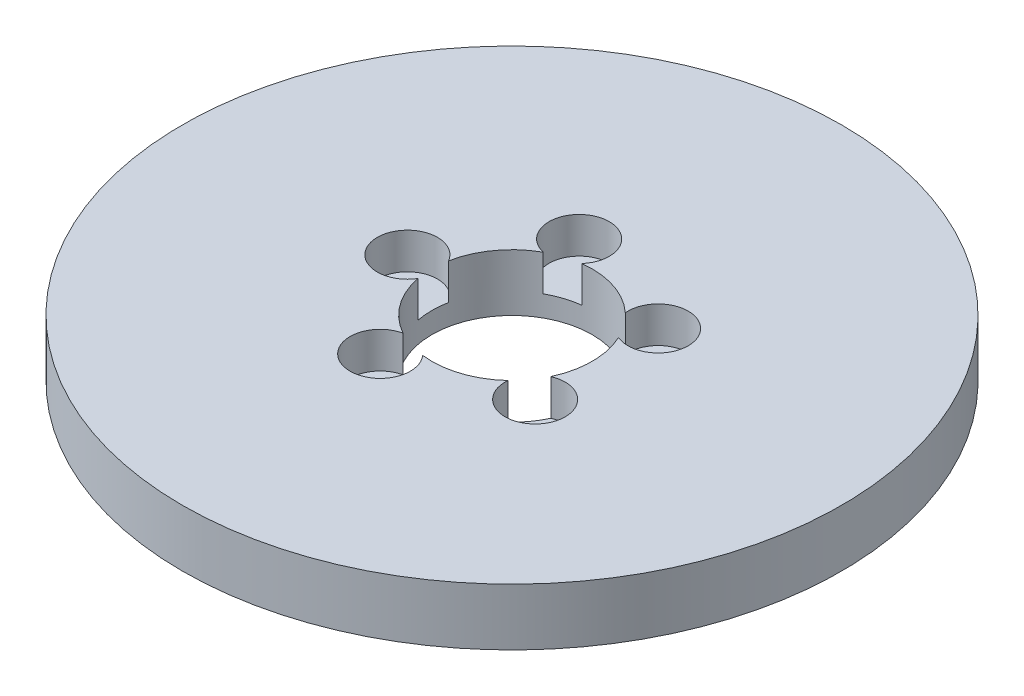
ISO-10303-21;
HEADER;
FILE_DESCRIPTION(('STEP AP214'),'2;1');
FILE_NAME('part.step','',(''),(''),'','','');
FILE_SCHEMA(('AUTOMOTIVE_DESIGN { 1 0 10303 214 1 1 1 1 }'));
ENDSEC;
DATA;
#1=APPLICATION_CONTEXT('core data for automotive mechanical design processes');
#2=APPLICATION_PROTOCOL_DEFINITION('international standard','automotive_design',2000,#1);
#3=PRODUCT_CONTEXT('',#1,'mechanical');
#4=PRODUCT('Part','Part','',(#3));
#5=PRODUCT_RELATED_PRODUCT_CATEGORY('part','',(#4));
#6=PRODUCT_DEFINITION_FORMATION('','',#4);
#7=PRODUCT_DEFINITION_CONTEXT('part definition',#1,'design');
#8=PRODUCT_DEFINITION('design','',#6,#7);
#9=PRODUCT_DEFINITION_SHAPE('','',#8);
#10=(LENGTH_UNIT() NAMED_UNIT(*) SI_UNIT(.MILLI.,.METRE.));
#11=(NAMED_UNIT(*) PLANE_ANGLE_UNIT() SI_UNIT($,.RADIAN.));
#12=(NAMED_UNIT(*) SI_UNIT($,.STERADIAN.) SOLID_ANGLE_UNIT());
#13=UNCERTAINTY_MEASURE_WITH_UNIT(LENGTH_MEASURE(1.E-05),#10,'distance_accuracy_value','');
#14=(GEOMETRIC_REPRESENTATION_CONTEXT(3) GLOBAL_UNCERTAINTY_ASSIGNED_CONTEXT((#13)) GLOBAL_UNIT_ASSIGNED_CONTEXT((#10,
#11,#12)) REPRESENTATION_CONTEXT('',''));
#15=CARTESIAN_POINT('',(0.,0.,0.));
#16=DIRECTION('',(0.,0.,1.));
#17=DIRECTION('',(1.,0.,0.));
#18=AXIS2_PLACEMENT_3D('',#15,#16,#17);
#19=CARTESIAN_POINT('',(0.,16.,0.));
#20=DIRECTION('',(0.,-1.,0.));
#21=DIRECTION('',(0.,0.,-1.));
#22=AXIS2_PLACEMENT_3D('',#19,#20,#21);
#23=CYLINDRICAL_SURFACE('',#22,92.5);
#24=CARTESIAN_POINT('',(0.,16.,0.));
#25=DIRECTION('',(0.,1.,0.));
#26=DIRECTION('',(0.,0.,1.));
#27=AXIS2_PLACEMENT_3D('',#24,#25,#26);
#28=CIRCLE('',#27,92.5);
#29=CARTESIAN_POINT('',(0.,16.,92.5));
#30=VERTEX_POINT('',#29);
#31=EDGE_CURVE('E157',#30,#30,#28,.T.);
#32=ORIENTED_EDGE('',*,*,#31,.F.);
#33=EDGE_LOOP('',(#32));
#34=FACE_BOUND('',#33,.T.);
#35=CARTESIAN_POINT('',(0.,0.,0.));
#36=DIRECTION('',(0.,1.,0.));
#37=DIRECTION('',(0.,0.,1.));
#38=AXIS2_PLACEMENT_3D('',#35,#36,#37);
#39=CIRCLE('',#38,92.5);
#40=CARTESIAN_POINT('',(0.,0.,92.5));
#41=VERTEX_POINT('',#40);
#42=EDGE_CURVE('E150',#41,#41,#39,.T.);
#43=ORIENTED_EDGE('',*,*,#42,.T.);
#44=EDGE_LOOP('',(#43));
#45=FACE_BOUND('',#44,.T.);
#46=ADVANCED_FACE('F39',(#34,#45),#23,.T.);
#47=CARTESIAN_POINT('',(0.,16.,0.));
#48=DIRECTION('',(0.,1.,0.));
#49=DIRECTION('',(0.,0.,1.));
#50=AXIS2_PLACEMENT_3D('',#47,#48,#49);
#51=PLANE('',#50);
#52=CARTESIAN_POINT('',(-9.07257051645491,16.,-27.9225009183538));
#53=DIRECTION('',(0.,1.,0.));
#54=DIRECTION('',(-0.95105651629515,0.,0.309016994374958));
#55=AXIS2_PLACEMENT_3D('',#52,#53,#54);
#56=CIRCLE('',#55,8.4477017152426);
#57=CARTESIAN_POINT('',(-2.73871040046969,16.,-22.3326994638436));
#58=VERTEX_POINT('',#57);
#59=CARTESIAN_POINT('',(-10.9111681320763,16.,-19.6773069802136));
#60=VERTEX_POINT('',#59);
#61=EDGE_CURVE('E194',#58,#60,#56,.T.);
#62=ORIENTED_EDGE('',*,*,#61,.F.);
#63=CARTESIAN_POINT('',(0.,16.,0.));
#64=DIRECTION('',(0.,1.,0.));
#65=DIRECTION('',(0.,0.,1.));
#66=AXIS2_PLACEMENT_3D('',#63,#64,#65);
#67=CIRCLE('',#66,22.5);
#68=CARTESIAN_POINT('',(15.3424946453783,16.,-16.457759812822));
#69=VERTEX_POINT('',#68);
#70=EDGE_CURVE('E147',#69,#58,#67,.T.);
#71=ORIENTED_EDGE('',*,*,#70,.F.);
#72=CARTESIAN_POINT('',(23.7522979774082,16.,-17.2570546184431));
#73=DIRECTION('',(0.,1.,0.));
#74=DIRECTION('',(-0.58778525229248,0.,-0.809016994374942));
#75=AXIS2_PLACEMENT_3D('',#72,#73,#74);
#76=CIRCLE('',#75,8.4477017152426);
#77=CARTESIAN_POINT('',(20.3933512951332,16.,-9.50585203720789));
#78=VERTEX_POINT('',#77);
#79=EDGE_CURVE('E254',#78,#69,#76,.T.);
#80=ORIENTED_EDGE('',*,*,#79,.F.);
#81=CARTESIAN_POINT('',(20.3933512951333,16.,9.5058520372076));
#82=VERTEX_POINT('',#81);
#83=EDGE_CURVE('E144',#82,#78,#67,.T.);
#84=ORIENTED_EDGE('',*,*,#83,.F.);
#85=CARTESIAN_POINT('',(23.7522979774084,16.,17.2570546184427));
#86=DIRECTION('',(0.,1.,0.));
#87=DIRECTION('',(0.587785252292469,0.,-0.809016994374951));
#88=AXIS2_PLACEMENT_3D('',#85,#86,#87);
#89=CIRCLE('',#88,8.4477017152426);
#90=CARTESIAN_POINT('',(15.3424946453786,16.,16.4577598128217));
#91=VERTEX_POINT('',#90);
#92=EDGE_CURVE('E141',#91,#82,#89,.T.);
#93=ORIENTED_EDGE('',*,*,#92,.F.);
#94=CARTESIAN_POINT('',(-2.73871040046937,16.,22.3326994638436));
#95=VERTEX_POINT('',#94);
#96=EDGE_CURVE('E134',#95,#91,#67,.T.);
#97=ORIENTED_EDGE('',*,*,#96,.F.);
#98=CARTESIAN_POINT('',(-9.07257051645452,16.,27.9225009183539));
#99=DIRECTION('',(0.,1.,0.));
#100=DIRECTION('',(0.951056516295155,0.,0.309016994374945));
#101=AXIS2_PLACEMENT_3D('',#98,#99,#100);
#102=CIRCLE('',#101,8.4477017152426);
#103=CARTESIAN_POINT('',(-10.9111681320761,16.,19.6773069802137));
#104=VERTEX_POINT('',#103);
#105=EDGE_CURVE('E111',#104,#95,#102,.T.);
#106=ORIENTED_EDGE('',*,*,#105,.F.);
#107=CARTESIAN_POINT('',(-22.0859674079662,16.,4.29651529198419));
#108=VERTEX_POINT('',#107);
#109=EDGE_CURVE('E145',#108,#104,#67,.T.);
#110=ORIENTED_EDGE('',*,*,#109,.F.);
#111=CARTESIAN_POINT('',(-29.3594549219074,16.,0.));
#112=DIRECTION('',(0.,1.,0.));
#113=DIRECTION('',(0.,0.,1.));
#114=AXIS2_PLACEMENT_3D('',#111,#112,#113);
#115=CIRCLE('',#114,8.4477017152426);
#116=CARTESIAN_POINT('',(-22.0859674079662,16.,-4.29651529198419));
#117=VERTEX_POINT('',#116);
#118=EDGE_CURVE('E153',#117,#108,#115,.T.);
#119=ORIENTED_EDGE('',*,*,#118,.F.);
#120=EDGE_CURVE('E146',#60,#117,#67,.T.);
#121=ORIENTED_EDGE('',*,*,#120,.F.);
#122=EDGE_LOOP('',(#62,#71,#80,#84,#93,#97,#106,#110,#119,#121));
#123=FACE_BOUND('',#122,.T.);
#124=ORIENTED_EDGE('',*,*,#31,.T.);
#125=EDGE_LOOP('',(#124));
#126=FACE_BOUND('',#125,.T.);
#127=ADVANCED_FACE('F139',(#123,#126),#51,.T.);
#128=CARTESIAN_POINT('',(0.,0.,0.));
#129=DIRECTION('',(0.,1.,0.));
#130=DIRECTION('',(0.,0.,1.));
#131=AXIS2_PLACEMENT_3D('',#128,#129,#130);
#132=PLANE('',#131);
#133=CARTESIAN_POINT('',(0.,0.,0.));
#134=DIRECTION('',(0.,1.,0.));
#135=DIRECTION('',(0.,0.,1.));
#136=AXIS2_PLACEMENT_3D('',#133,#134,#135);
#137=CIRCLE('',#136,22.5);
#138=CARTESIAN_POINT('',(0.,0.,22.5));
#139=VERTEX_POINT('',#138);
#140=EDGE_CURVE('E154',#139,#139,#137,.T.);
#141=ORIENTED_EDGE('',*,*,#140,.T.);
#142=EDGE_LOOP('',(#141));
#143=FACE_BOUND('',#142,.T.);
#144=ORIENTED_EDGE('',*,*,#42,.F.);
#145=EDGE_LOOP('',(#144));
#146=FACE_BOUND('',#145,.T.);
#147=ADVANCED_FACE('F213',(#143,#146),#132,.F.);
#148=CARTESIAN_POINT('',(0.,16.,0.));
#149=DIRECTION('',(0.,-1.,0.));
#150=DIRECTION('',(0.,0.,-1.));
#151=AXIS2_PLACEMENT_3D('',#148,#149,#150);
#152=CYLINDRICAL_SURFACE('',#151,22.5);
#153=DIRECTION('',(0.,1.,0.));
#154=VECTOR('',#153,1.);
#155=CARTESIAN_POINT('',(-2.73871040046969,10.933876950996,-22.3326994638436));
#156=LINE('',#155,#154);
#157=CARTESIAN_POINT('',(-2.73871040046969,5.86775390199197,-22.3326994638436));
#158=VERTEX_POINT('',#157);
#159=EDGE_CURVE('E11',#158,#58,#156,.T.);
#160=ORIENTED_EDGE('',*,*,#159,.F.);
#161=CARTESIAN_POINT('',(0.,5.86775390199197,0.));
#162=DIRECTION('',(0.,1.,0.));
#163=DIRECTION('',(0.,0.,1.));
#164=AXIS2_PLACEMENT_3D('',#161,#162,#163);
#165=CIRCLE('',#164,22.5);
#166=CARTESIAN_POINT('',(-10.9111681320763,5.86775390199197,-19.6773069802136));
#167=VERTEX_POINT('',#166);
#168=EDGE_CURVE('E189',#158,#167,#165,.T.);
#169=ORIENTED_EDGE('',*,*,#168,.T.);
#170=DIRECTION('',(0.,1.,0.));
#171=VECTOR('',#170,1.);
#172=CARTESIAN_POINT('',(-10.9111681320763,10.933876950996,-19.6773069802136));
#173=LINE('',#172,#171);
#174=EDGE_CURVE('E46',#60,#167,#173,.F.);
#175=ORIENTED_EDGE('',*,*,#174,.F.);
#176=ORIENTED_EDGE('',*,*,#120,.T.);
#177=DIRECTION('',(0.,1.,0.));
#178=VECTOR('',#177,1.);
#179=CARTESIAN_POINT('',(-22.0859674079662,10.933876950996,-4.29651529198418));
#180=LINE('',#179,#178);
#181=CARTESIAN_POINT('',(-22.0859674079662,5.86775390199197,-4.29651529198419));
#182=VERTEX_POINT('',#181);
#183=EDGE_CURVE('E168',#182,#117,#180,.T.);
#184=ORIENTED_EDGE('',*,*,#183,.F.);
#185=CARTESIAN_POINT('',(0.,5.86775390199197,0.));
#186=DIRECTION('',(0.,1.,0.));
#187=DIRECTION('',(0.,0.,1.));
#188=AXIS2_PLACEMENT_3D('',#185,#186,#187);
#189=CIRCLE('',#188,22.5);
#190=CARTESIAN_POINT('',(-22.0859674079662,5.86775390199197,4.29651529198419));
#191=VERTEX_POINT('',#190);
#192=EDGE_CURVE('E165',#182,#191,#189,.T.);
#193=ORIENTED_EDGE('',*,*,#192,.T.);
#194=DIRECTION('',(0.,1.,0.));
#195=VECTOR('',#194,1.);
#196=CARTESIAN_POINT('',(-22.0859674079662,10.933876950996,4.29651529198418));
#197=LINE('',#196,#195);
#198=EDGE_CURVE('E170',#108,#191,#197,.F.);
#199=ORIENTED_EDGE('',*,*,#198,.F.);
#200=ORIENTED_EDGE('',*,*,#109,.T.);
#201=DIRECTION('',(0.,1.,0.));
#202=VECTOR('',#201,1.);
#203=CARTESIAN_POINT('',(-10.911168132076,10.933876950996,19.6773069802137));
#204=LINE('',#203,#202);
#205=CARTESIAN_POINT('',(-10.9111681320761,5.86775390199197,19.6773069802137));
#206=VERTEX_POINT('',#205);
#207=EDGE_CURVE('E121',#206,#104,#204,.T.);
#208=ORIENTED_EDGE('',*,*,#207,.F.);
#209=CARTESIAN_POINT('',(0.,5.86775390199197,0.));
#210=DIRECTION('',(0.,1.,0.));
#211=DIRECTION('',(0.,0.,1.));
#212=AXIS2_PLACEMENT_3D('',#209,#210,#211);
#213=CIRCLE('',#212,22.5);
#214=CARTESIAN_POINT('',(-2.73871040046937,5.86775390199197,22.3326994638436));
#215=VERTEX_POINT('',#214);
#216=EDGE_CURVE('E136',#206,#215,#213,.T.);
#217=ORIENTED_EDGE('',*,*,#216,.T.);
#218=DIRECTION('',(0.,1.,0.));
#219=VECTOR('',#218,1.);
#220=CARTESIAN_POINT('',(-2.73871040046937,10.933876950996,22.3326994638436));
#221=LINE('',#220,#219);
#222=EDGE_CURVE('E117',#95,#215,#221,.F.);
#223=ORIENTED_EDGE('',*,*,#222,.F.);
#224=ORIENTED_EDGE('',*,*,#96,.T.);
#225=DIRECTION('',(0.,1.,0.));
#226=VECTOR('',#225,1.);
#227=CARTESIAN_POINT('',(15.3424946453786,10.933876950996,16.4577598128217));
#228=LINE('',#227,#226);
#229=CARTESIAN_POINT('',(15.3424946453786,5.86775390199197,16.4577598128217));
#230=VERTEX_POINT('',#229);
#231=EDGE_CURVE('E182',#230,#91,#228,.T.);
#232=ORIENTED_EDGE('',*,*,#231,.F.);
#233=CARTESIAN_POINT('',(0.,5.86775390199197,0.));
#234=DIRECTION('',(0.,1.,0.));
#235=DIRECTION('',(0.,0.,1.));
#236=AXIS2_PLACEMENT_3D('',#233,#234,#235);
#237=CIRCLE('',#236,22.5);
#238=CARTESIAN_POINT('',(20.3933512951333,5.86775390199197,9.5058520372076));
#239=VERTEX_POINT('',#238);
#240=EDGE_CURVE('E174',#230,#239,#237,.T.);
#241=ORIENTED_EDGE('',*,*,#240,.T.);
#242=DIRECTION('',(0.,1.,0.));
#243=VECTOR('',#242,1.);
#244=CARTESIAN_POINT('',(20.3933512951333,10.933876950996,9.5058520372076));
#245=LINE('',#244,#243);
#246=EDGE_CURVE('E177',#82,#239,#245,.F.);
#247=ORIENTED_EDGE('',*,*,#246,.F.);
#248=ORIENTED_EDGE('',*,*,#83,.T.);
#249=DIRECTION('',(0.,1.,0.));
#250=VECTOR('',#249,1.);
#251=CARTESIAN_POINT('',(20.3933512951332,10.933876950996,-9.50585203720789));
#252=LINE('',#251,#250);
#253=CARTESIAN_POINT('',(20.3933512951332,5.86775390199197,-9.50585203720789));
#254=VERTEX_POINT('',#253);
#255=EDGE_CURVE('E187',#254,#78,#252,.T.);
#256=ORIENTED_EDGE('',*,*,#255,.F.);
#257=CARTESIAN_POINT('',(0.,5.86775390199197,0.));
#258=DIRECTION('',(0.,1.,0.));
#259=DIRECTION('',(0.,0.,1.));
#260=AXIS2_PLACEMENT_3D('',#257,#258,#259);
#261=CIRCLE('',#260,22.5);
#262=CARTESIAN_POINT('',(15.3424946453783,5.86775390199197,-16.457759812822));
#263=VERTEX_POINT('',#262);
#264=EDGE_CURVE('E181',#254,#263,#261,.T.);
#265=ORIENTED_EDGE('',*,*,#264,.T.);
#266=DIRECTION('',(0.,1.,0.));
#267=VECTOR('',#266,1.);
#268=CARTESIAN_POINT('',(15.3424946453783,10.933876950996,-16.457759812822));
#269=LINE('',#268,#267);
#270=EDGE_CURVE('E186',#69,#263,#269,.F.);
#271=ORIENTED_EDGE('',*,*,#270,.F.);
#272=ORIENTED_EDGE('',*,*,#70,.T.);
#273=EDGE_LOOP('',(#160,#169,#175,#176,#184,#193,#199,#200,#208,#217,#223,#224,#232,#241,#247,
#248,#256,#265,#271,#272));
#274=FACE_BOUND('',#273,.T.);
#275=ORIENTED_EDGE('',*,*,#140,.F.);
#276=EDGE_LOOP('',(#275));
#277=FACE_BOUND('',#276,.T.);
#278=ADVANCED_FACE('F135',(#274,#277),#152,.F.);
#279=CARTESIAN_POINT('',(-29.3594549219074,5.86775390199197,0.));
#280=DIRECTION('',(0.,1.,0.));
#281=DIRECTION('',(0.,0.,1.));
#282=AXIS2_PLACEMENT_3D('',#279,#280,#281);
#283=CYLINDRICAL_SURFACE('',#282,8.4477017152426);
#284=ORIENTED_EDGE('',*,*,#183,.T.);
#285=ORIENTED_EDGE('',*,*,#118,.T.);
#286=ORIENTED_EDGE('',*,*,#198,.T.);
#287=CARTESIAN_POINT('',(-29.3594549219074,5.86775390199197,0.));
#288=DIRECTION('',(0.,1.,0.));
#289=DIRECTION('',(0.,0.,1.));
#290=AXIS2_PLACEMENT_3D('',#287,#288,#289);
#291=CIRCLE('',#290,8.4477017152426);
#292=EDGE_CURVE('E158',#182,#191,#291,.T.);
#293=ORIENTED_EDGE('',*,*,#292,.F.);
#294=EDGE_LOOP('',(#284,#285,#286,#293));
#295=FACE_BOUND('',#294,.T.);
#296=ADVANCED_FACE('F221',(#295),#283,.F.);
#297=CARTESIAN_POINT('',(-29.3594549219074,5.86775390199197,0.));
#298=DIRECTION('',(0.,1.,0.));
#299=DIRECTION('',(0.,0.,1.));
#300=AXIS2_PLACEMENT_3D('',#297,#298,#299);
#301=PLANE('',#300);
#302=ORIENTED_EDGE('',*,*,#292,.T.);
#303=ORIENTED_EDGE('',*,*,#192,.F.);
#304=EDGE_LOOP('',(#302,#303));
#305=FACE_BOUND('',#304,.T.);
#306=ADVANCED_FACE('F227',(#305),#301,.T.);
#307=CARTESIAN_POINT('',(-9.07257051645452,5.86775390199197,27.9225009183539));
#308=DIRECTION('',(0.,1.,0.));
#309=DIRECTION('',(0.,0.,1.));
#310=AXIS2_PLACEMENT_3D('',#307,#308,#309);
#311=CYLINDRICAL_SURFACE('',#310,8.4477017152426);
#312=ORIENTED_EDGE('',*,*,#207,.T.);
#313=ORIENTED_EDGE('',*,*,#105,.T.);
#314=ORIENTED_EDGE('',*,*,#222,.T.);
#315=CARTESIAN_POINT('',(-9.07257051645452,5.86775390199197,27.9225009183539));
#316=DIRECTION('',(0.,1.,0.));
#317=DIRECTION('',(0.951056516295155,0.,0.309016994374945));
#318=AXIS2_PLACEMENT_3D('',#315,#316,#317);
#319=CIRCLE('',#318,8.4477017152426);
#320=EDGE_CURVE('E127',#206,#215,#319,.T.);
#321=ORIENTED_EDGE('',*,*,#320,.F.);
#322=EDGE_LOOP('',(#312,#313,#314,#321));
#323=FACE_BOUND('',#322,.T.);
#324=ADVANCED_FACE('F116',(#323),#311,.F.);
#325=CARTESIAN_POINT('',(-9.07257051645452,5.86775390199197,27.9225009183539));
#326=DIRECTION('',(0.,1.,0.));
#327=DIRECTION('',(0.951056516295155,0.,0.309016994374945));
#328=AXIS2_PLACEMENT_3D('',#325,#326,#327);
#329=PLANE('',#328);
#330=ORIENTED_EDGE('',*,*,#320,.T.);
#331=ORIENTED_EDGE('',*,*,#216,.F.);
#332=EDGE_LOOP('',(#330,#331));
#333=FACE_BOUND('',#332,.T.);
#334=ADVANCED_FACE('F234',(#333),#329,.T.);
#335=CARTESIAN_POINT('',(23.7522979774084,5.86775390199197,17.2570546184427));
#336=DIRECTION('',(0.,1.,0.));
#337=DIRECTION('',(0.,0.,1.));
#338=AXIS2_PLACEMENT_3D('',#335,#336,#337);
#339=CYLINDRICAL_SURFACE('',#338,8.4477017152426);
#340=ORIENTED_EDGE('',*,*,#231,.T.);
#341=ORIENTED_EDGE('',*,*,#92,.T.);
#342=ORIENTED_EDGE('',*,*,#246,.T.);
#343=CARTESIAN_POINT('',(23.7522979774084,5.86775390199197,17.2570546184427));
#344=DIRECTION('',(0.,1.,0.));
#345=DIRECTION('',(0.587785252292469,0.,-0.809016994374951));
#346=AXIS2_PLACEMENT_3D('',#343,#344,#345);
#347=CIRCLE('',#346,8.4477017152426);
#348=EDGE_CURVE('E130',#230,#239,#347,.T.);
#349=ORIENTED_EDGE('',*,*,#348,.F.);
#350=EDGE_LOOP('',(#340,#341,#342,#349));
#351=FACE_BOUND('',#350,.T.);
#352=ADVANCED_FACE('F240',(#351),#339,.F.);
#353=CARTESIAN_POINT('',(23.7522979774084,5.86775390199197,17.2570546184427));
#354=DIRECTION('',(0.,1.,0.));
#355=DIRECTION('',(0.587785252292469,0.,-0.809016994374951));
#356=AXIS2_PLACEMENT_3D('',#353,#354,#355);
#357=PLANE('',#356);
#358=ORIENTED_EDGE('',*,*,#348,.T.);
#359=ORIENTED_EDGE('',*,*,#240,.F.);
#360=EDGE_LOOP('',(#358,#359));
#361=FACE_BOUND('',#360,.T.);
#362=ADVANCED_FACE('F245',(#361),#357,.T.);
#363=CARTESIAN_POINT('',(23.7522979774082,5.86775390199197,-17.2570546184431));
#364=DIRECTION('',(0.,1.,0.));
#365=DIRECTION('',(0.,0.,1.));
#366=AXIS2_PLACEMENT_3D('',#363,#364,#365);
#367=CYLINDRICAL_SURFACE('',#366,8.4477017152426);
#368=ORIENTED_EDGE('',*,*,#255,.T.);
#369=ORIENTED_EDGE('',*,*,#79,.T.);
#370=ORIENTED_EDGE('',*,*,#270,.T.);
#371=CARTESIAN_POINT('',(23.7522979774082,5.86775390199197,-17.2570546184431));
#372=DIRECTION('',(0.,1.,0.));
#373=DIRECTION('',(-0.58778525229248,0.,-0.809016994374942));
#374=AXIS2_PLACEMENT_3D('',#371,#372,#373);
#375=CIRCLE('',#374,8.4477017152426);
#376=EDGE_CURVE('E56',#254,#263,#375,.T.);
#377=ORIENTED_EDGE('',*,*,#376,.F.);
#378=EDGE_LOOP('',(#368,#369,#370,#377));
#379=FACE_BOUND('',#378,.T.);
#380=ADVANCED_FACE('F266',(#379),#367,.F.);
#381=CARTESIAN_POINT('',(23.7522979774082,5.86775390199197,-17.2570546184431));
#382=DIRECTION('',(0.,1.,0.));
#383=DIRECTION('',(-0.58778525229248,0.,-0.809016994374942));
#384=AXIS2_PLACEMENT_3D('',#381,#382,#383);
#385=PLANE('',#384);
#386=ORIENTED_EDGE('',*,*,#376,.T.);
#387=ORIENTED_EDGE('',*,*,#264,.F.);
#388=EDGE_LOOP('',(#386,#387));
#389=FACE_BOUND('',#388,.T.);
#390=ADVANCED_FACE('F204',(#389),#385,.T.);
#391=CARTESIAN_POINT('',(-9.07257051645491,5.86775390199197,-27.9225009183538));
#392=DIRECTION('',(0.,1.,0.));
#393=DIRECTION('',(0.,0.,1.));
#394=AXIS2_PLACEMENT_3D('',#391,#392,#393);
#395=CYLINDRICAL_SURFACE('',#394,8.4477017152426);
#396=ORIENTED_EDGE('',*,*,#159,.T.);
#397=ORIENTED_EDGE('',*,*,#61,.T.);
#398=ORIENTED_EDGE('',*,*,#174,.T.);
#399=CARTESIAN_POINT('',(-9.07257051645491,5.86775390199197,-27.9225009183538));
#400=DIRECTION('',(0.,1.,0.));
#401=DIRECTION('',(-0.95105651629515,0.,0.309016994374958));
#402=AXIS2_PLACEMENT_3D('',#399,#400,#401);
#403=CIRCLE('',#402,8.4477017152426);
#404=EDGE_CURVE('E55',#158,#167,#403,.T.);
#405=ORIENTED_EDGE('',*,*,#404,.F.);
#406=EDGE_LOOP('',(#396,#397,#398,#405));
#407=FACE_BOUND('',#406,.T.);
#408=ADVANCED_FACE('F193',(#407),#395,.F.);
#409=CARTESIAN_POINT('',(-9.07257051645491,5.86775390199197,-27.9225009183538));
#410=DIRECTION('',(0.,1.,0.));
#411=DIRECTION('',(-0.95105651629515,0.,0.309016994374958));
#412=AXIS2_PLACEMENT_3D('',#409,#410,#411);
#413=PLANE('',#412);
#414=ORIENTED_EDGE('',*,*,#404,.T.);
#415=ORIENTED_EDGE('',*,*,#168,.F.);
#416=EDGE_LOOP('',(#414,#415));
#417=FACE_BOUND('',#416,.T.);
#418=ADVANCED_FACE('F196',(#417),#413,.T.);
#419=CLOSED_SHELL('',(#46,#127,#147,#278,#296,#306,#324,#334,#352,#362,#380,#390,#408,#418));
#420=MANIFOLD_SOLID_BREP('B2',#419);
#421=ADVANCED_BREP_SHAPE_REPRESENTATION('',(#18,#420),#14);
#422=SHAPE_DEFINITION_REPRESENTATION(#9,#421);
ENDSEC;
END-ISO-10303-21;
